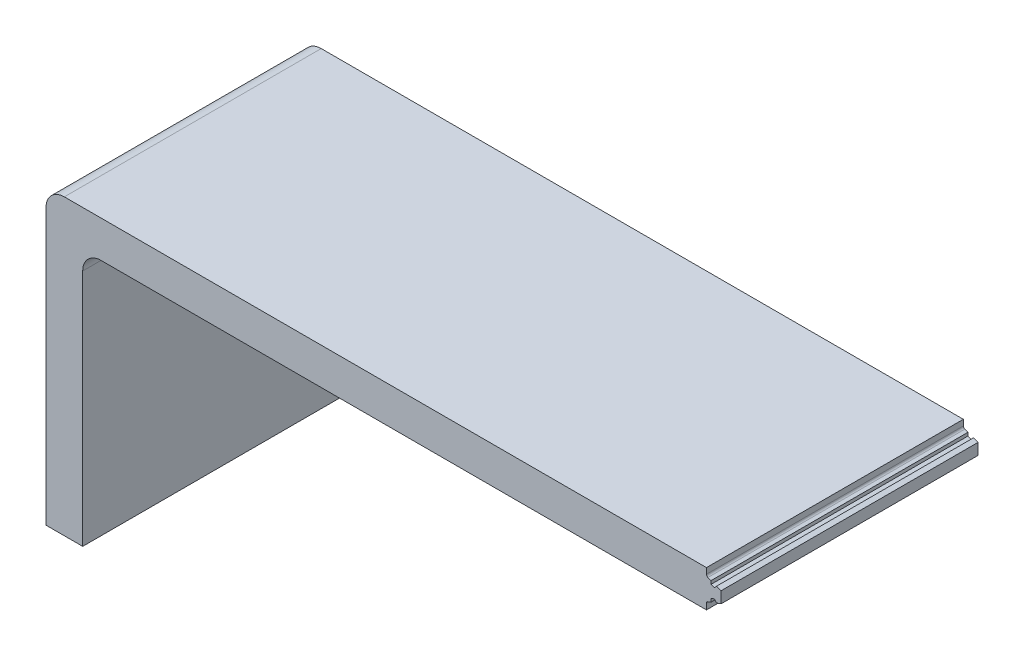
ISO-10303-21;
HEADER;
FILE_DESCRIPTION(('STEP AP214'),'2;1');
FILE_NAME('part.step','',(''),(''),'','','');
FILE_SCHEMA(('AUTOMOTIVE_DESIGN { 1 0 10303 214 1 1 1 1 }'));
ENDSEC;
DATA;
#1=APPLICATION_CONTEXT('core data for automotive mechanical design processes');
#2=APPLICATION_PROTOCOL_DEFINITION('international standard','automotive_design',2000,#1);
#3=PRODUCT_CONTEXT('',#1,'mechanical');
#4=PRODUCT('Part','Part','',(#3));
#5=PRODUCT_RELATED_PRODUCT_CATEGORY('part','',(#4));
#6=PRODUCT_DEFINITION_FORMATION('','',#4);
#7=PRODUCT_DEFINITION_CONTEXT('part definition',#1,'design');
#8=PRODUCT_DEFINITION('design','',#6,#7);
#9=PRODUCT_DEFINITION_SHAPE('','',#8);
#10=(LENGTH_UNIT() NAMED_UNIT(*) SI_UNIT(.MILLI.,.METRE.));
#11=(NAMED_UNIT(*) PLANE_ANGLE_UNIT() SI_UNIT($,.RADIAN.));
#12=(NAMED_UNIT(*) SI_UNIT($,.STERADIAN.) SOLID_ANGLE_UNIT());
#13=UNCERTAINTY_MEASURE_WITH_UNIT(LENGTH_MEASURE(1.E-05),#10,'distance_accuracy_value','');
#14=(GEOMETRIC_REPRESENTATION_CONTEXT(3) GLOBAL_UNCERTAINTY_ASSIGNED_CONTEXT((#13)) GLOBAL_UNIT_ASSIGNED_CONTEXT((#10,
#11,#12)) REPRESENTATION_CONTEXT('',''));
#15=CARTESIAN_POINT('',(0.,0.,0.));
#16=DIRECTION('',(0.,0.,1.));
#17=DIRECTION('',(1.,0.,0.));
#18=AXIS2_PLACEMENT_3D('',#15,#16,#17);
#19=CARTESIAN_POINT('',(12.7,0.,88.9));
#20=DIRECTION('',(0.,1.,0.));
#21=DIRECTION('',(-1.,0.,0.));
#22=AXIS2_PLACEMENT_3D('',#19,#20,#21);
#23=PLANE('',#22);
#24=DIRECTION('',(1.,0.,0.));
#25=VECTOR('',#24,1.);
#26=CARTESIAN_POINT('',(12.7,0.,0.));
#27=LINE('',#26,#25);
#28=CARTESIAN_POINT('',(0.,0.,0.));
#29=VERTEX_POINT('',#28);
#30=CARTESIAN_POINT('',(12.7,0.,0.));
#31=VERTEX_POINT('',#30);
#32=EDGE_CURVE('E325',#29,#31,#27,.T.);
#33=ORIENTED_EDGE('',*,*,#32,.T.);
#34=DIRECTION('',(0.,0.,-1.));
#35=VECTOR('',#34,1.);
#36=CARTESIAN_POINT('',(12.7,0.,88.9));
#37=LINE('',#36,#35);
#38=CARTESIAN_POINT('',(12.7,0.,88.9));
#39=VERTEX_POINT('',#38);
#40=EDGE_CURVE('E345',#39,#31,#37,.T.);
#41=ORIENTED_EDGE('',*,*,#40,.F.);
#42=DIRECTION('',(1.,0.,0.));
#43=VECTOR('',#42,1.);
#44=CARTESIAN_POINT('',(12.7,0.,88.9));
#45=LINE('',#44,#43);
#46=CARTESIAN_POINT('',(0.,0.,88.9));
#47=VERTEX_POINT('',#46);
#48=EDGE_CURVE('E301',#47,#39,#45,.T.);
#49=ORIENTED_EDGE('',*,*,#48,.F.);
#50=DIRECTION('',(0.,0.,-1.));
#51=VECTOR('',#50,1.);
#52=CARTESIAN_POINT('',(0.,0.,88.9));
#53=LINE('',#52,#51);
#54=EDGE_CURVE('E324',#47,#29,#53,.T.);
#55=ORIENTED_EDGE('',*,*,#54,.T.);
#56=EDGE_LOOP('',(#33,#41,#49,#55));
#57=FACE_BOUND('',#56,.T.);
#58=ADVANCED_FACE('F45',(#57),#23,.F.);
#59=CARTESIAN_POINT('',(12.7,88.9,88.9));
#60=DIRECTION('',(-1.,0.,0.));
#61=DIRECTION('',(0.,-1.,0.));
#62=AXIS2_PLACEMENT_3D('',#59,#60,#61);
#63=PLANE('',#62);
#64=DIRECTION('',(0.,1.,0.));
#65=VECTOR('',#64,1.);
#66=CARTESIAN_POINT('',(12.7,88.9,0.));
#67=LINE('',#66,#65);
#68=CARTESIAN_POINT('',(12.7,82.55,0.));
#69=VERTEX_POINT('',#68);
#70=EDGE_CURVE('E220',#31,#69,#67,.T.);
#71=ORIENTED_EDGE('',*,*,#70,.T.);
#72=DIRECTION('',(0.,0.,-1.));
#73=VECTOR('',#72,1.);
#74=CARTESIAN_POINT('',(12.7,82.55,88.9));
#75=LINE('',#74,#73);
#76=CARTESIAN_POINT('',(12.7,82.55,88.9));
#77=VERTEX_POINT('',#76);
#78=EDGE_CURVE('E351',#69,#77,#75,.F.);
#79=ORIENTED_EDGE('',*,*,#78,.T.);
#80=DIRECTION('',(0.,1.,0.));
#81=VECTOR('',#80,1.);
#82=CARTESIAN_POINT('',(12.7,88.9,88.9));
#83=LINE('',#82,#81);
#84=EDGE_CURVE('E305',#39,#77,#83,.T.);
#85=ORIENTED_EDGE('',*,*,#84,.F.);
#86=ORIENTED_EDGE('',*,*,#40,.T.);
#87=EDGE_LOOP('',(#71,#79,#85,#86));
#88=FACE_BOUND('',#87,.T.);
#89=ADVANCED_FACE('F470',(#88),#63,.F.);
#90=CARTESIAN_POINT('',(233.68,88.9,88.9));
#91=DIRECTION('',(0.,1.,0.));
#92=DIRECTION('',(-1.,0.,0.));
#93=AXIS2_PLACEMENT_3D('',#90,#91,#92);
#94=PLANE('',#93);
#95=DIRECTION('',(1.,0.,0.));
#96=VECTOR('',#95,1.);
#97=CARTESIAN_POINT('',(233.68,88.9,88.9));
#98=LINE('',#97,#96);
#99=CARTESIAN_POINT('',(19.05,88.9,88.9));
#100=VERTEX_POINT('',#99);
#101=CARTESIAN_POINT('',(228.6,88.9,88.9));
#102=VERTEX_POINT('',#101);
#103=EDGE_CURVE('E310',#100,#102,#98,.T.);
#104=ORIENTED_EDGE('',*,*,#103,.F.);
#105=DIRECTION('',(0.,0.,-1.));
#106=VECTOR('',#105,1.);
#107=CARTESIAN_POINT('',(19.05,88.9,0.));
#108=LINE('',#107,#106);
#109=CARTESIAN_POINT('',(19.05,88.9,0.));
#110=VERTEX_POINT('',#109);
#111=EDGE_CURVE('E217',#100,#110,#108,.T.);
#112=ORIENTED_EDGE('',*,*,#111,.T.);
#113=DIRECTION('',(1.,0.,0.));
#114=VECTOR('',#113,1.);
#115=CARTESIAN_POINT('',(233.68,88.9,0.));
#116=LINE('',#115,#114);
#117=CARTESIAN_POINT('',(228.6,88.9,0.));
#118=VERTEX_POINT('',#117);
#119=EDGE_CURVE('E198',#110,#118,#116,.T.);
#120=ORIENTED_EDGE('',*,*,#119,.T.);
#121=DIRECTION('',(0.,0.,1.));
#122=VECTOR('',#121,1.);
#123=CARTESIAN_POINT('',(228.6,88.9,0.));
#124=LINE('',#123,#122);
#125=EDGE_CURVE('E215',#118,#102,#124,.T.);
#126=ORIENTED_EDGE('',*,*,#125,.T.);
#127=EDGE_LOOP('',(#104,#112,#120,#126));
#128=FACE_BOUND('',#127,.T.);
#129=ADVANCED_FACE('F214',(#128),#94,.F.);
#130=CARTESIAN_POINT('',(233.68,88.9,88.9));
#131=DIRECTION('',(-1.,0.,0.));
#132=DIRECTION('',(0.,0.,1.));
#133=AXIS2_PLACEMENT_3D('',#130,#131,#132);
#134=PLANE('',#133);
#135=DIRECTION('',(0.,1.,0.));
#136=VECTOR('',#135,1.);
#137=CARTESIAN_POINT('',(233.68,88.9,88.9));
#138=LINE('',#137,#136);
#139=CARTESIAN_POINT('',(233.68,93.2889687900724,88.9));
#140=VERTEX_POINT('',#139);
#141=CARTESIAN_POINT('',(233.68,97.2110312099276,88.9));
#142=VERTEX_POINT('',#141);
#143=EDGE_CURVE('E313',#140,#142,#138,.T.);
#144=ORIENTED_EDGE('',*,*,#143,.F.);
#145=DIRECTION('',(0.,0.,1.));
#146=VECTOR('',#145,1.);
#147=CARTESIAN_POINT('',(233.68,93.2889687900724,0.));
#148=LINE('',#147,#146);
#149=CARTESIAN_POINT('',(233.68,93.2889687900724,0.));
#150=VERTEX_POINT('',#149);
#151=EDGE_CURVE('E227',#150,#140,#148,.T.);
#152=ORIENTED_EDGE('',*,*,#151,.F.);
#153=DIRECTION('',(0.,1.,0.));
#154=VECTOR('',#153,1.);
#155=CARTESIAN_POINT('',(233.68,88.9,0.));
#156=LINE('',#155,#154);
#157=CARTESIAN_POINT('',(233.68,97.2110312099276,0.));
#158=VERTEX_POINT('',#157);
#159=EDGE_CURVE('E219',#150,#158,#156,.T.);
#160=ORIENTED_EDGE('',*,*,#159,.T.);
#161=DIRECTION('',(0.,0.,1.));
#162=VECTOR('',#161,1.);
#163=CARTESIAN_POINT('',(233.68,97.2110312099276,0.));
#164=LINE('',#163,#162);
#165=EDGE_CURVE('E252',#158,#142,#164,.T.);
#166=ORIENTED_EDGE('',*,*,#165,.T.);
#167=EDGE_LOOP('',(#144,#152,#160,#166));
#168=FACE_BOUND('',#167,.T.);
#169=ADVANCED_FACE('F443',(#168),#134,.F.);
#170=CARTESIAN_POINT('',(0.,101.6,88.9));
#171=DIRECTION('',(0.,-1.,0.));
#172=DIRECTION('',(0.,0.,-1.));
#173=AXIS2_PLACEMENT_3D('',#170,#171,#172);
#174=PLANE('',#173);
#175=DIRECTION('',(-1.,0.,0.));
#176=VECTOR('',#175,1.);
#177=CARTESIAN_POINT('',(0.,101.6,0.));
#178=LINE('',#177,#176);
#179=CARTESIAN_POINT('',(228.6,101.6,0.));
#180=VERTEX_POINT('',#179);
#181=CARTESIAN_POINT('',(6.35,101.6,0.));
#182=VERTEX_POINT('',#181);
#183=EDGE_CURVE('E336',#180,#182,#178,.T.);
#184=ORIENTED_EDGE('',*,*,#183,.T.);
#185=DIRECTION('',(0.,0.,-1.));
#186=VECTOR('',#185,1.);
#187=CARTESIAN_POINT('',(6.35,101.6,88.9));
#188=LINE('',#187,#186);
#189=CARTESIAN_POINT('',(6.35,101.6,88.9));
#190=VERTEX_POINT('',#189);
#191=EDGE_CURVE('E361',#182,#190,#188,.F.);
#192=ORIENTED_EDGE('',*,*,#191,.T.);
#193=DIRECTION('',(-1.,0.,0.));
#194=VECTOR('',#193,1.);
#195=CARTESIAN_POINT('',(0.,101.6,88.9));
#196=LINE('',#195,#194);
#197=CARTESIAN_POINT('',(228.6,101.6,88.9));
#198=VERTEX_POINT('',#197);
#199=EDGE_CURVE('E317',#198,#190,#196,.T.);
#200=ORIENTED_EDGE('',*,*,#199,.F.);
#201=DIRECTION('',(0.,0.,1.));
#202=VECTOR('',#201,1.);
#203=CARTESIAN_POINT('',(228.6,101.6,0.));
#204=LINE('',#203,#202);
#205=EDGE_CURVE('E256',#180,#198,#204,.T.);
#206=ORIENTED_EDGE('',*,*,#205,.F.);
#207=EDGE_LOOP('',(#184,#192,#200,#206));
#208=FACE_BOUND('',#207,.T.);
#209=ADVANCED_FACE('F486',(#208),#174,.F.);
#210=CARTESIAN_POINT('',(0.,0.,88.9));
#211=DIRECTION('',(1.,0.,0.));
#212=DIRECTION('',(0.,0.,-1.));
#213=AXIS2_PLACEMENT_3D('',#210,#211,#212);
#214=PLANE('',#213);
#215=DIRECTION('',(0.,-1.,0.));
#216=VECTOR('',#215,1.);
#217=CARTESIAN_POINT('',(0.,0.,88.9));
#218=LINE('',#217,#216);
#219=CARTESIAN_POINT('',(0.,95.25,88.9));
#220=VERTEX_POINT('',#219);
#221=EDGE_CURVE('E321',#220,#47,#218,.T.);
#222=ORIENTED_EDGE('',*,*,#221,.F.);
#223=DIRECTION('',(0.,0.,-1.));
#224=VECTOR('',#223,1.);
#225=CARTESIAN_POINT('',(0.,95.25,88.9));
#226=LINE('',#225,#224);
#227=CARTESIAN_POINT('',(0.,95.25,0.));
#228=VERTEX_POINT('',#227);
#229=EDGE_CURVE('E354',#220,#228,#226,.T.);
#230=ORIENTED_EDGE('',*,*,#229,.T.);
#231=DIRECTION('',(0.,-1.,0.));
#232=VECTOR('',#231,1.);
#233=CARTESIAN_POINT('',(0.,0.,0.));
#234=LINE('',#233,#232);
#235=EDGE_CURVE('E306',#228,#29,#234,.T.);
#236=ORIENTED_EDGE('',*,*,#235,.T.);
#237=ORIENTED_EDGE('',*,*,#54,.F.);
#238=EDGE_LOOP('',(#222,#230,#236,#237));
#239=FACE_BOUND('',#238,.T.);
#240=ADVANCED_FACE('F478',(#239),#214,.F.);
#241=CARTESIAN_POINT('',(0.,0.,88.9));
#242=DIRECTION('',(0.,0.,-1.));
#243=DIRECTION('',(-1.,0.,0.));
#244=AXIS2_PLACEMENT_3D('',#241,#242,#243);
#245=PLANE('',#244);
#246=ORIENTED_EDGE('',*,*,#199,.T.);
#247=CARTESIAN_POINT('',(6.35,95.25,88.9));
#248=DIRECTION('',(0.,0.,-1.));
#249=DIRECTION('',(-1.,0.,0.));
#250=AXIS2_PLACEMENT_3D('',#247,#248,#249);
#251=CIRCLE('',#250,6.35);
#252=EDGE_CURVE('E364',#190,#220,#251,.F.);
#253=ORIENTED_EDGE('',*,*,#252,.T.);
#254=ORIENTED_EDGE('',*,*,#221,.T.);
#255=ORIENTED_EDGE('',*,*,#48,.T.);
#256=ORIENTED_EDGE('',*,*,#84,.T.);
#257=CARTESIAN_POINT('',(19.05,82.55,88.9));
#258=DIRECTION('',(0.,0.,-1.));
#259=DIRECTION('',(-1.,0.,0.));
#260=AXIS2_PLACEMENT_3D('',#257,#258,#259);
#261=CIRCLE('',#260,6.35);
#262=EDGE_CURVE('E370',#77,#100,#261,.T.);
#263=ORIENTED_EDGE('',*,*,#262,.T.);
#264=ORIENTED_EDGE('',*,*,#103,.T.);
#265=DIRECTION('',(0.,-1.,0.));
#266=VECTOR('',#265,1.);
#267=CARTESIAN_POINT('',(228.6,88.9,88.9));
#268=LINE('',#267,#266);
#269=CARTESIAN_POINT('',(228.6,90.9064419407366,88.9));
#270=VERTEX_POINT('',#269);
#271=EDGE_CURVE('E224',#270,#102,#268,.T.);
#272=ORIENTED_EDGE('',*,*,#271,.F.);
#273=CARTESIAN_POINT('',(229.362,90.9064419407366,88.9));
#274=DIRECTION('',(0.,0.,-1.));
#275=DIRECTION('',(-1.,0.,0.));
#276=AXIS2_PLACEMENT_3D('',#273,#274,#275);
#277=CIRCLE('',#276,0.762);
#278=CARTESIAN_POINT('',(229.101380662503,91.6224877220403,88.9));
#279=VERTEX_POINT('',#278);
#280=EDGE_CURVE('E385',#270,#279,#277,.T.);
#281=ORIENTED_EDGE('',*,*,#280,.T.);
#282=DIRECTION('',(-0.939692626382864,-0.34202012794816,0.));
#283=VECTOR('',#282,1.);
#284=CARTESIAN_POINT('',(228.6,91.4400000941441,88.9));
#285=LINE('',#284,#283);
#286=CARTESIAN_POINT('',(230.178469435979,92.0145159552869,88.9));
#287=VERTEX_POINT('',#286);
#288=EDGE_CURVE('E208',#287,#279,#285,.T.);
#289=ORIENTED_EDGE('',*,*,#288,.F.);
#290=DIRECTION('',(0.,-1.,0.));
#291=VECTOR('',#290,1.);
#292=CARTESIAN_POINT('',(230.178469435979,92.0145159552869,88.9));
#293=LINE('',#292,#291);
#294=CARTESIAN_POINT('',(230.178469435979,93.149652207838,88.9));
#295=VERTEX_POINT('',#294);
#296=EDGE_CURVE('E407',#295,#287,#293,.T.);
#297=ORIENTED_EDGE('',*,*,#296,.F.);
#298=DIRECTION('',(-0.939692626382874,-0.342020127948132,0.));
#299=VECTOR('',#298,1.);
#300=CARTESIAN_POINT('',(230.178469435979,93.149652207838,88.9));
#301=LINE('',#300,#299);
#302=CARTESIAN_POINT('',(231.371879071486,93.5840177703322,88.9));
#303=VERTEX_POINT('',#302);
#304=EDGE_CURVE('E411',#303,#295,#301,.T.);
#305=ORIENTED_EDGE('',*,*,#304,.F.);
#306=DIRECTION('',(-0.642787584614822,0.766044464156647,0.));
#307=VECTOR('',#306,1.);
#308=CARTESIAN_POINT('',(232.101530561472,92.7144529280018,88.9));
#309=LINE('',#308,#307);
#310=CARTESIAN_POINT('',(232.101530561472,92.7144529280018,88.9));
#311=VERTEX_POINT('',#310);
#312=EDGE_CURVE('E415',#311,#303,#309,.T.);
#313=ORIENTED_EDGE('',*,*,#312,.F.);
#314=DIRECTION('',(-0.939692626382873,-0.342020127948135,0.));
#315=VECTOR('',#314,1.);
#316=CARTESIAN_POINT('',(232.101530561472,92.7144529280018,88.9));
#317=LINE('',#316,#315);
#318=EDGE_CURVE('E418',#140,#311,#317,.T.);
#319=ORIENTED_EDGE('',*,*,#318,.F.);
#320=ORIENTED_EDGE('',*,*,#143,.T.);
#321=DIRECTION('',(0.939692626382871,-0.34202012794814,0.));
#322=VECTOR('',#321,1.);
#323=CARTESIAN_POINT('',(232.101530561472,97.7855470719982,88.9));
#324=LINE('',#323,#322);
#325=CARTESIAN_POINT('',(232.101530561472,97.7855470719982,88.9));
#326=VERTEX_POINT('',#325);
#327=EDGE_CURVE('E259',#326,#142,#324,.T.);
#328=ORIENTED_EDGE('',*,*,#327,.F.);
#329=DIRECTION('',(0.642787584614822,0.766044464156647,0.));
#330=VECTOR('',#329,1.);
#331=CARTESIAN_POINT('',(232.101530561472,97.7855470719982,88.9));
#332=LINE('',#331,#330);
#333=CARTESIAN_POINT('',(231.371879071486,96.9159822296678,88.9));
#334=VERTEX_POINT('',#333);
#335=EDGE_CURVE('E262',#334,#326,#332,.T.);
#336=ORIENTED_EDGE('',*,*,#335,.F.);
#337=DIRECTION('',(0.939692626382874,-0.342020127948132,0.));
#338=VECTOR('',#337,1.);
#339=CARTESIAN_POINT('',(230.178469435979,97.350347792162,88.9));
#340=LINE('',#339,#338);
#341=CARTESIAN_POINT('',(230.178469435979,97.350347792162,88.9));
#342=VERTEX_POINT('',#341);
#343=EDGE_CURVE('E267',#342,#334,#340,.T.);
#344=ORIENTED_EDGE('',*,*,#343,.F.);
#345=DIRECTION('',(0.,-1.,0.));
#346=VECTOR('',#345,1.);
#347=CARTESIAN_POINT('',(230.178469435979,98.4854840447131,88.9));
#348=LINE('',#347,#346);
#349=CARTESIAN_POINT('',(230.178469435979,98.4854840447131,88.9));
#350=VERTEX_POINT('',#349);
#351=EDGE_CURVE('E271',#350,#342,#348,.T.);
#352=ORIENTED_EDGE('',*,*,#351,.F.);
#353=DIRECTION('',(0.939692626382871,-0.342020127948139,0.));
#354=VECTOR('',#353,1.);
#355=CARTESIAN_POINT('',(228.6,99.0599999058559,88.9));
#356=LINE('',#355,#354);
#357=CARTESIAN_POINT('',(229.101380662503,98.8775122779597,88.9));
#358=VERTEX_POINT('',#357);
#359=EDGE_CURVE('E275',#358,#350,#356,.T.);
#360=ORIENTED_EDGE('',*,*,#359,.F.);
#361=CARTESIAN_POINT('',(229.362,99.5935580592634,88.9));
#362=DIRECTION('',(0.,0.,-1.));
#363=DIRECTION('',(-1.,0.,0.));
#364=AXIS2_PLACEMENT_3D('',#361,#362,#363);
#365=CIRCLE('',#364,0.762);
#366=CARTESIAN_POINT('',(228.6,99.5935580592634,88.9));
#367=VERTEX_POINT('',#366);
#368=EDGE_CURVE('E54',#358,#367,#365,.T.);
#369=ORIENTED_EDGE('',*,*,#368,.T.);
#370=DIRECTION('',(0.,-1.,0.));
#371=VECTOR('',#370,1.);
#372=CARTESIAN_POINT('',(228.6,101.6,88.9));
#373=LINE('',#372,#371);
#374=EDGE_CURVE('E278',#198,#367,#373,.T.);
#375=ORIENTED_EDGE('',*,*,#374,.F.);
#376=EDGE_LOOP('',(#246,#253,#254,#255,#256,#263,#264,#272,#281,#289,#297,#305,#313,#319,#320,
#328,#336,#344,#352,#360,#369,#375));
#377=FACE_BOUND('',#376,.T.);
#378=ADVANCED_FACE('F445',(#377),#245,.F.);
#379=CARTESIAN_POINT('',(0.,0.,0.));
#380=DIRECTION('',(0.,0.,-1.));
#381=DIRECTION('',(-1.,0.,0.));
#382=AXIS2_PLACEMENT_3D('',#379,#380,#381);
#383=PLANE('',#382);
#384=ORIENTED_EDGE('',*,*,#235,.F.);
#385=CARTESIAN_POINT('',(6.35,95.25,0.));
#386=DIRECTION('',(0.,0.,-1.));
#387=DIRECTION('',(-1.,0.,0.));
#388=AXIS2_PLACEMENT_3D('',#385,#386,#387);
#389=CIRCLE('',#388,6.35);
#390=EDGE_CURVE('E358',#228,#182,#389,.T.);
#391=ORIENTED_EDGE('',*,*,#390,.T.);
#392=ORIENTED_EDGE('',*,*,#183,.F.);
#393=DIRECTION('',(0.,-1.,0.));
#394=VECTOR('',#393,1.);
#395=CARTESIAN_POINT('',(228.6,101.6,0.));
#396=LINE('',#395,#394);
#397=CARTESIAN_POINT('',(228.6,99.5935580592634,0.));
#398=VERTEX_POINT('',#397);
#399=EDGE_CURVE('E263',#180,#398,#396,.T.);
#400=ORIENTED_EDGE('',*,*,#399,.T.);
#401=CARTESIAN_POINT('',(229.362,99.5935580592634,0.));
#402=DIRECTION('',(0.,0.,-1.));
#403=DIRECTION('',(-1.,0.,0.));
#404=AXIS2_PLACEMENT_3D('',#401,#402,#403);
#405=CIRCLE('',#404,0.762);
#406=CARTESIAN_POINT('',(229.101380662503,98.8775122779597,0.));
#407=VERTEX_POINT('',#406);
#408=EDGE_CURVE('E11',#398,#407,#405,.F.);
#409=ORIENTED_EDGE('',*,*,#408,.T.);
#410=DIRECTION('',(0.939692626382871,-0.342020127948139,0.));
#411=VECTOR('',#410,1.);
#412=CARTESIAN_POINT('',(228.6,99.0599999058559,0.));
#413=LINE('',#412,#411);
#414=CARTESIAN_POINT('',(230.178469435979,98.4854840447131,0.));
#415=VERTEX_POINT('',#414);
#416=EDGE_CURVE('E296',#407,#415,#413,.T.);
#417=ORIENTED_EDGE('',*,*,#416,.T.);
#418=DIRECTION('',(0.,-1.,0.));
#419=VECTOR('',#418,1.);
#420=CARTESIAN_POINT('',(230.178469435979,98.4854840447131,0.));
#421=LINE('',#420,#419);
#422=CARTESIAN_POINT('',(230.178469435979,97.350347792162,0.));
#423=VERTEX_POINT('',#422);
#424=EDGE_CURVE('E292',#415,#423,#421,.T.);
#425=ORIENTED_EDGE('',*,*,#424,.T.);
#426=DIRECTION('',(0.939692626382874,-0.342020127948132,0.));
#427=VECTOR('',#426,1.);
#428=CARTESIAN_POINT('',(230.178469435979,97.350347792162,0.));
#429=LINE('',#428,#427);
#430=CARTESIAN_POINT('',(231.371879071486,96.9159822296678,0.));
#431=VERTEX_POINT('',#430);
#432=EDGE_CURVE('E288',#423,#431,#429,.T.);
#433=ORIENTED_EDGE('',*,*,#432,.T.);
#434=DIRECTION('',(0.642787584614822,0.766044464156647,0.));
#435=VECTOR('',#434,1.);
#436=CARTESIAN_POINT('',(232.101530561472,97.7855470719982,0.));
#437=LINE('',#436,#435);
#438=CARTESIAN_POINT('',(232.101530561472,97.7855470719982,0.));
#439=VERTEX_POINT('',#438);
#440=EDGE_CURVE('E284',#431,#439,#437,.T.);
#441=ORIENTED_EDGE('',*,*,#440,.T.);
#442=DIRECTION('',(0.939692626382871,-0.34202012794814,0.));
#443=VECTOR('',#442,1.);
#444=CARTESIAN_POINT('',(232.101530561472,97.7855470719982,0.));
#445=LINE('',#444,#443);
#446=EDGE_CURVE('E242',#439,#158,#445,.T.);
#447=ORIENTED_EDGE('',*,*,#446,.T.);
#448=ORIENTED_EDGE('',*,*,#159,.F.);
#449=DIRECTION('',(-0.939692626382873,-0.342020127948135,0.));
#450=VECTOR('',#449,1.);
#451=CARTESIAN_POINT('',(232.101530561472,92.7144529280018,0.));
#452=LINE('',#451,#450);
#453=CARTESIAN_POINT('',(232.101530561472,92.7144529280018,0.));
#454=VERTEX_POINT('',#453);
#455=EDGE_CURVE('E207',#150,#454,#452,.T.);
#456=ORIENTED_EDGE('',*,*,#455,.T.);
#457=DIRECTION('',(-0.642787584614822,0.766044464156647,0.));
#458=VECTOR('',#457,1.);
#459=CARTESIAN_POINT('',(232.101530561472,92.7144529280018,0.));
#460=LINE('',#459,#458);
#461=CARTESIAN_POINT('',(231.371879071486,93.5840177703322,0.));
#462=VERTEX_POINT('',#461);
#463=EDGE_CURVE('E430',#454,#462,#460,.T.);
#464=ORIENTED_EDGE('',*,*,#463,.T.);
#465=DIRECTION('',(-0.939692626382874,-0.342020127948132,0.));
#466=VECTOR('',#465,1.);
#467=CARTESIAN_POINT('',(230.178469435979,93.149652207838,0.));
#468=LINE('',#467,#466);
#469=CARTESIAN_POINT('',(230.178469435979,93.149652207838,0.));
#470=VERTEX_POINT('',#469);
#471=EDGE_CURVE('E426',#462,#470,#468,.T.);
#472=ORIENTED_EDGE('',*,*,#471,.T.);
#473=DIRECTION('',(0.,-1.,0.));
#474=VECTOR('',#473,1.);
#475=CARTESIAN_POINT('',(230.178469435979,92.0145159552869,0.));
#476=LINE('',#475,#474);
#477=CARTESIAN_POINT('',(230.178469435979,92.0145159552869,0.));
#478=VERTEX_POINT('',#477);
#479=EDGE_CURVE('E234',#470,#478,#476,.T.);
#480=ORIENTED_EDGE('',*,*,#479,.T.);
#481=DIRECTION('',(-0.939692626382864,-0.34202012794816,0.));
#482=VECTOR('',#481,1.);
#483=CARTESIAN_POINT('',(228.6,91.4400000941441,0.));
#484=LINE('',#483,#482);
#485=CARTESIAN_POINT('',(229.101380662503,91.6224877220403,0.));
#486=VERTEX_POINT('',#485);
#487=EDGE_CURVE('E228',#478,#486,#484,.T.);
#488=ORIENTED_EDGE('',*,*,#487,.T.);
#489=CARTESIAN_POINT('',(229.362,90.9064419407366,0.));
#490=DIRECTION('',(0.,0.,-1.));
#491=DIRECTION('',(-1.,0.,0.));
#492=AXIS2_PLACEMENT_3D('',#489,#490,#491);
#493=CIRCLE('',#492,0.762);
#494=CARTESIAN_POINT('',(228.6,90.9064419407366,0.));
#495=VERTEX_POINT('',#494);
#496=EDGE_CURVE('E201',#486,#495,#493,.F.);
#497=ORIENTED_EDGE('',*,*,#496,.T.);
#498=DIRECTION('',(0.,-1.,0.));
#499=VECTOR('',#498,1.);
#500=CARTESIAN_POINT('',(228.6,88.9,0.));
#501=LINE('',#500,#499);
#502=EDGE_CURVE('E194',#495,#118,#501,.T.);
#503=ORIENTED_EDGE('',*,*,#502,.T.);
#504=ORIENTED_EDGE('',*,*,#119,.F.);
#505=CARTESIAN_POINT('',(19.05,82.55,0.));
#506=DIRECTION('',(0.,0.,-1.));
#507=DIRECTION('',(-1.,0.,0.));
#508=AXIS2_PLACEMENT_3D('',#505,#506,#507);
#509=CIRCLE('',#508,6.35);
#510=EDGE_CURVE('E367',#110,#69,#509,.F.);
#511=ORIENTED_EDGE('',*,*,#510,.T.);
#512=ORIENTED_EDGE('',*,*,#70,.F.);
#513=ORIENTED_EDGE('',*,*,#32,.F.);
#514=EDGE_LOOP('',(#384,#391,#392,#400,#409,#417,#425,#433,#441,#447,#448,#456,#464,#472,#480,
#488,#497,#503,#504,#511,#512,#513));
#515=FACE_BOUND('',#514,.T.);
#516=ADVANCED_FACE('F197',(#515),#383,.T.);
#517=CARTESIAN_POINT('',(228.6,101.6,0.));
#518=DIRECTION('',(-1.,0.,0.));
#519=DIRECTION('',(0.,-1.,0.));
#520=AXIS2_PLACEMENT_3D('',#517,#518,#519);
#521=PLANE('',#520);
#522=ORIENTED_EDGE('',*,*,#374,.T.);
#523=DIRECTION('',(0.,0.,1.));
#524=VECTOR('',#523,1.);
#525=CARTESIAN_POINT('',(228.6,99.5935580592634,0.));
#526=LINE('',#525,#524);
#527=EDGE_CURVE('E61',#367,#398,#526,.F.);
#528=ORIENTED_EDGE('',*,*,#527,.T.);
#529=ORIENTED_EDGE('',*,*,#399,.F.);
#530=ORIENTED_EDGE('',*,*,#205,.T.);
#531=EDGE_LOOP('',(#522,#528,#529,#530));
#532=FACE_BOUND('',#531,.T.);
#533=ADVANCED_FACE('F488',(#532),#521,.F.);
#534=CARTESIAN_POINT('',(232.101530561472,97.7855470719982,0.));
#535=DIRECTION('',(-0.34202012794814,-0.939692626382871,0.));
#536=DIRECTION('',(0.939692626382871,-0.34202012794814,0.));
#537=AXIS2_PLACEMENT_3D('',#534,#535,#536);
#538=PLANE('',#537);
#539=ORIENTED_EDGE('',*,*,#327,.T.);
#540=ORIENTED_EDGE('',*,*,#165,.F.);
#541=ORIENTED_EDGE('',*,*,#446,.F.);
#542=DIRECTION('',(0.,0.,1.));
#543=VECTOR('',#542,1.);
#544=CARTESIAN_POINT('',(232.101530561472,97.7855470719982,0.));
#545=LINE('',#544,#543);
#546=EDGE_CURVE('E249',#439,#326,#545,.T.);
#547=ORIENTED_EDGE('',*,*,#546,.T.);
#548=EDGE_LOOP('',(#539,#540,#541,#547));
#549=FACE_BOUND('',#548,.T.);
#550=ADVANCED_FACE('F509',(#549),#538,.F.);
#551=CARTESIAN_POINT('',(232.101530561472,97.7855470719982,0.));
#552=DIRECTION('',(0.766044464156646,-0.642787584614822,0.));
#553=DIRECTION('',(0.642787584614822,0.766044464156646,0.));
#554=AXIS2_PLACEMENT_3D('',#551,#552,#553);
#555=PLANE('',#554);
#556=ORIENTED_EDGE('',*,*,#335,.T.);
#557=ORIENTED_EDGE('',*,*,#546,.F.);
#558=ORIENTED_EDGE('',*,*,#440,.F.);
#559=DIRECTION('',(0.,0.,1.));
#560=VECTOR('',#559,1.);
#561=CARTESIAN_POINT('',(231.371879071486,96.9159822296678,0.));
#562=LINE('',#561,#560);
#563=EDGE_CURVE('E246',#431,#334,#562,.T.);
#564=ORIENTED_EDGE('',*,*,#563,.T.);
#565=EDGE_LOOP('',(#556,#557,#558,#564));
#566=FACE_BOUND('',#565,.T.);
#567=ADVANCED_FACE('F507',(#566),#555,.F.);
#568=CARTESIAN_POINT('',(230.178469435979,97.350347792162,0.));
#569=DIRECTION('',(-0.342020127948132,-0.939692626382874,0.));
#570=DIRECTION('',(0.939692626382874,-0.342020127948132,0.));
#571=AXIS2_PLACEMENT_3D('',#568,#569,#570);
#572=PLANE('',#571);
#573=ORIENTED_EDGE('',*,*,#343,.T.);
#574=ORIENTED_EDGE('',*,*,#563,.F.);
#575=ORIENTED_EDGE('',*,*,#432,.F.);
#576=DIRECTION('',(0.,0.,1.));
#577=VECTOR('',#576,1.);
#578=CARTESIAN_POINT('',(230.178469435979,97.350347792162,0.));
#579=LINE('',#578,#577);
#580=EDGE_CURVE('E243',#423,#342,#579,.T.);
#581=ORIENTED_EDGE('',*,*,#580,.T.);
#582=EDGE_LOOP('',(#573,#574,#575,#581));
#583=FACE_BOUND('',#582,.T.);
#584=ADVANCED_FACE('F502',(#583),#572,.F.);
#585=CARTESIAN_POINT('',(230.178469435979,98.4854840447131,0.));
#586=DIRECTION('',(-1.,0.,0.));
#587=DIRECTION('',(0.,-1.,0.));
#588=AXIS2_PLACEMENT_3D('',#585,#586,#587);
#589=PLANE('',#588);
#590=ORIENTED_EDGE('',*,*,#351,.T.);
#591=ORIENTED_EDGE('',*,*,#580,.F.);
#592=ORIENTED_EDGE('',*,*,#424,.F.);
#593=DIRECTION('',(0.,0.,1.));
#594=VECTOR('',#593,1.);
#595=CARTESIAN_POINT('',(230.178469435979,98.4854840447131,0.));
#596=LINE('',#595,#594);
#597=EDGE_CURVE('E238',#415,#350,#596,.T.);
#598=ORIENTED_EDGE('',*,*,#597,.T.);
#599=EDGE_LOOP('',(#590,#591,#592,#598));
#600=FACE_BOUND('',#599,.T.);
#601=ADVANCED_FACE('F499',(#600),#589,.F.);
#602=CARTESIAN_POINT('',(228.6,99.0599999058559,0.));
#603=DIRECTION('',(-0.342020127948139,-0.939692626382871,0.));
#604=DIRECTION('',(0.939692626382871,-0.342020127948139,0.));
#605=AXIS2_PLACEMENT_3D('',#602,#603,#604);
#606=PLANE('',#605);
#607=ORIENTED_EDGE('',*,*,#416,.F.);
#608=DIRECTION('',(0.,0.,1.));
#609=VECTOR('',#608,1.);
#610=CARTESIAN_POINT('',(229.101380662503,98.8775122779597,88.9));
#611=LINE('',#610,#609);
#612=EDGE_CURVE('E379',#407,#358,#611,.T.);
#613=ORIENTED_EDGE('',*,*,#612,.T.);
#614=ORIENTED_EDGE('',*,*,#359,.T.);
#615=ORIENTED_EDGE('',*,*,#597,.F.);
#616=EDGE_LOOP('',(#607,#613,#614,#615));
#617=FACE_BOUND('',#616,.T.);
#618=ADVANCED_FACE('F496',(#617),#606,.F.);
#619=CARTESIAN_POINT('',(228.6,88.9,0.));
#620=DIRECTION('',(-1.,0.,0.));
#621=DIRECTION('',(0.,0.,1.));
#622=AXIS2_PLACEMENT_3D('',#619,#620,#621);
#623=PLANE('',#622);
#624=ORIENTED_EDGE('',*,*,#502,.F.);
#625=DIRECTION('',(0.,0.,1.));
#626=VECTOR('',#625,1.);
#627=CARTESIAN_POINT('',(228.6,90.9064419407366,88.9));
#628=LINE('',#627,#626);
#629=EDGE_CURVE('E373',#495,#270,#628,.T.);
#630=ORIENTED_EDGE('',*,*,#629,.T.);
#631=ORIENTED_EDGE('',*,*,#271,.T.);
#632=ORIENTED_EDGE('',*,*,#125,.F.);
#633=EDGE_LOOP('',(#624,#630,#631,#632));
#634=FACE_BOUND('',#633,.T.);
#635=ADVANCED_FACE('F222',(#634),#623,.F.);
#636=CARTESIAN_POINT('',(228.6,91.4400000941441,0.));
#637=DIRECTION('',(-0.34202012794816,0.939692626382863,0.));
#638=DIRECTION('',(-0.939692626382864,-0.342020127948161,0.));
#639=AXIS2_PLACEMENT_3D('',#636,#637,#638);
#640=PLANE('',#639);
#641=ORIENTED_EDGE('',*,*,#288,.T.);
#642=DIRECTION('',(0.,0.,1.));
#643=VECTOR('',#642,1.);
#644=CARTESIAN_POINT('',(229.101380662503,91.6224877220403,0.));
#645=LINE('',#644,#643);
#646=EDGE_CURVE('E376',#279,#486,#645,.F.);
#647=ORIENTED_EDGE('',*,*,#646,.T.);
#648=ORIENTED_EDGE('',*,*,#487,.F.);
#649=DIRECTION('',(0.,0.,1.));
#650=VECTOR('',#649,1.);
#651=CARTESIAN_POINT('',(230.178469435979,92.0145159552869,0.));
#652=LINE('',#651,#650);
#653=EDGE_CURVE('E329',#478,#287,#652,.T.);
#654=ORIENTED_EDGE('',*,*,#653,.T.);
#655=EDGE_LOOP('',(#641,#647,#648,#654));
#656=FACE_BOUND('',#655,.T.);
#657=ADVANCED_FACE('F460',(#656),#640,.F.);
#658=CARTESIAN_POINT('',(230.178469435979,92.0145159552869,0.));
#659=DIRECTION('',(-1.,0.,0.));
#660=DIRECTION('',(0.,-1.,0.));
#661=AXIS2_PLACEMENT_3D('',#658,#659,#660);
#662=PLANE('',#661);
#663=ORIENTED_EDGE('',*,*,#296,.T.);
#664=ORIENTED_EDGE('',*,*,#653,.F.);
#665=ORIENTED_EDGE('',*,*,#479,.F.);
#666=DIRECTION('',(0.,0.,1.));
#667=VECTOR('',#666,1.);
#668=CARTESIAN_POINT('',(230.178469435979,93.149652207838,0.));
#669=LINE('',#668,#667);
#670=EDGE_CURVE('E392',#470,#295,#669,.T.);
#671=ORIENTED_EDGE('',*,*,#670,.T.);
#672=EDGE_LOOP('',(#663,#664,#665,#671));
#673=FACE_BOUND('',#672,.T.);
#674=ADVANCED_FACE('F457',(#673),#662,.F.);
#675=CARTESIAN_POINT('',(230.178469435979,93.149652207838,0.));
#676=DIRECTION('',(-0.342020127948132,0.939692626382874,0.));
#677=DIRECTION('',(-0.939692626382874,-0.342020127948132,0.));
#678=AXIS2_PLACEMENT_3D('',#675,#676,#677);
#679=PLANE('',#678);
#680=ORIENTED_EDGE('',*,*,#304,.T.);
#681=ORIENTED_EDGE('',*,*,#670,.F.);
#682=ORIENTED_EDGE('',*,*,#471,.F.);
#683=DIRECTION('',(0.,0.,1.));
#684=VECTOR('',#683,1.);
#685=CARTESIAN_POINT('',(231.371879071486,93.5840177703322,0.));
#686=LINE('',#685,#684);
#687=EDGE_CURVE('E395',#462,#303,#686,.T.);
#688=ORIENTED_EDGE('',*,*,#687,.T.);
#689=EDGE_LOOP('',(#680,#681,#682,#688));
#690=FACE_BOUND('',#689,.T.);
#691=ADVANCED_FACE('F453',(#690),#679,.F.);
#692=CARTESIAN_POINT('',(232.101530561472,92.7144529280018,0.));
#693=DIRECTION('',(0.766044464156646,0.642787584614822,0.));
#694=DIRECTION('',(-0.642787584614822,0.766044464156646,0.));
#695=AXIS2_PLACEMENT_3D('',#692,#693,#694);
#696=PLANE('',#695);
#697=ORIENTED_EDGE('',*,*,#312,.T.);
#698=ORIENTED_EDGE('',*,*,#687,.F.);
#699=ORIENTED_EDGE('',*,*,#463,.F.);
#700=DIRECTION('',(0.,0.,1.));
#701=VECTOR('',#700,1.);
#702=CARTESIAN_POINT('',(232.101530561472,92.7144529280018,0.));
#703=LINE('',#702,#701);
#704=EDGE_CURVE('E232',#454,#311,#703,.T.);
#705=ORIENTED_EDGE('',*,*,#704,.T.);
#706=EDGE_LOOP('',(#697,#698,#699,#705));
#707=FACE_BOUND('',#706,.T.);
#708=ADVANCED_FACE('F450',(#707),#696,.F.);
#709=CARTESIAN_POINT('',(232.101530561472,92.7144529280018,0.));
#710=DIRECTION('',(-0.342020127948135,0.939692626382873,0.));
#711=DIRECTION('',(-0.939692626382873,-0.342020127948135,0.));
#712=AXIS2_PLACEMENT_3D('',#709,#710,#711);
#713=PLANE('',#712);
#714=ORIENTED_EDGE('',*,*,#318,.T.);
#715=ORIENTED_EDGE('',*,*,#704,.F.);
#716=ORIENTED_EDGE('',*,*,#455,.F.);
#717=ORIENTED_EDGE('',*,*,#151,.T.);
#718=EDGE_LOOP('',(#714,#715,#716,#717));
#719=FACE_BOUND('',#718,.T.);
#720=ADVANCED_FACE('F439',(#719),#713,.F.);
#721=CARTESIAN_POINT('',(19.05,82.55,88.9));
#722=DIRECTION('',(0.,0.,1.));
#723=DIRECTION('',(1.,0.,0.));
#724=AXIS2_PLACEMENT_3D('',#721,#722,#723);
#725=CYLINDRICAL_SURFACE('',#724,6.35);
#726=ORIENTED_EDGE('',*,*,#262,.F.);
#727=ORIENTED_EDGE('',*,*,#78,.F.);
#728=ORIENTED_EDGE('',*,*,#510,.F.);
#729=ORIENTED_EDGE('',*,*,#111,.F.);
#730=EDGE_LOOP('',(#726,#727,#728,#729));
#731=FACE_BOUND('',#730,.T.);
#732=ADVANCED_FACE('F466',(#731),#725,.F.);
#733=CARTESIAN_POINT('',(6.35,95.25,88.9));
#734=DIRECTION('',(0.,0.,-1.));
#735=DIRECTION('',(-1.,0.,0.));
#736=AXIS2_PLACEMENT_3D('',#733,#734,#735);
#737=CYLINDRICAL_SURFACE('',#736,6.35);
#738=ORIENTED_EDGE('',*,*,#252,.F.);
#739=ORIENTED_EDGE('',*,*,#191,.F.);
#740=ORIENTED_EDGE('',*,*,#390,.F.);
#741=ORIENTED_EDGE('',*,*,#229,.F.);
#742=EDGE_LOOP('',(#738,#739,#740,#741));
#743=FACE_BOUND('',#742,.T.);
#744=ADVANCED_FACE('F482',(#743),#737,.T.);
#745=CARTESIAN_POINT('',(229.362,90.9064419407366,0.));
#746=DIRECTION('',(0.,0.,-1.));
#747=DIRECTION('',(-1.,0.,0.));
#748=AXIS2_PLACEMENT_3D('',#745,#746,#747);
#749=CYLINDRICAL_SURFACE('',#748,0.762);
#750=ORIENTED_EDGE('',*,*,#496,.F.);
#751=ORIENTED_EDGE('',*,*,#646,.F.);
#752=ORIENTED_EDGE('',*,*,#280,.F.);
#753=ORIENTED_EDGE('',*,*,#629,.F.);
#754=EDGE_LOOP('',(#750,#751,#752,#753));
#755=FACE_BOUND('',#754,.T.);
#756=ADVANCED_FACE('F463',(#755),#749,.F.);
#757=CARTESIAN_POINT('',(229.362,99.5935580592634,0.));
#758=DIRECTION('',(0.,0.,-1.));
#759=DIRECTION('',(-1.,0.,0.));
#760=AXIS2_PLACEMENT_3D('',#757,#758,#759);
#761=CYLINDRICAL_SURFACE('',#760,0.762);
#762=ORIENTED_EDGE('',*,*,#408,.F.);
#763=ORIENTED_EDGE('',*,*,#527,.F.);
#764=ORIENTED_EDGE('',*,*,#368,.F.);
#765=ORIENTED_EDGE('',*,*,#612,.F.);
#766=EDGE_LOOP('',(#762,#763,#764,#765));
#767=FACE_BOUND('',#766,.T.);
#768=ADVANCED_FACE('F47',(#767),#761,.F.);
#769=CLOSED_SHELL('',(#58,#89,#129,#169,#209,#240,#378,#516,#533,#550,#567,#584,#601,#618,#635,
#657,#674,#691,#708,#720,#732,#744,#756,#768));
#770=MANIFOLD_SOLID_BREP('B2',#769);
#771=ADVANCED_BREP_SHAPE_REPRESENTATION('',(#18,#770),#14);
#772=SHAPE_DEFINITION_REPRESENTATION(#9,#771);
ENDSEC;
END-ISO-10303-21;
